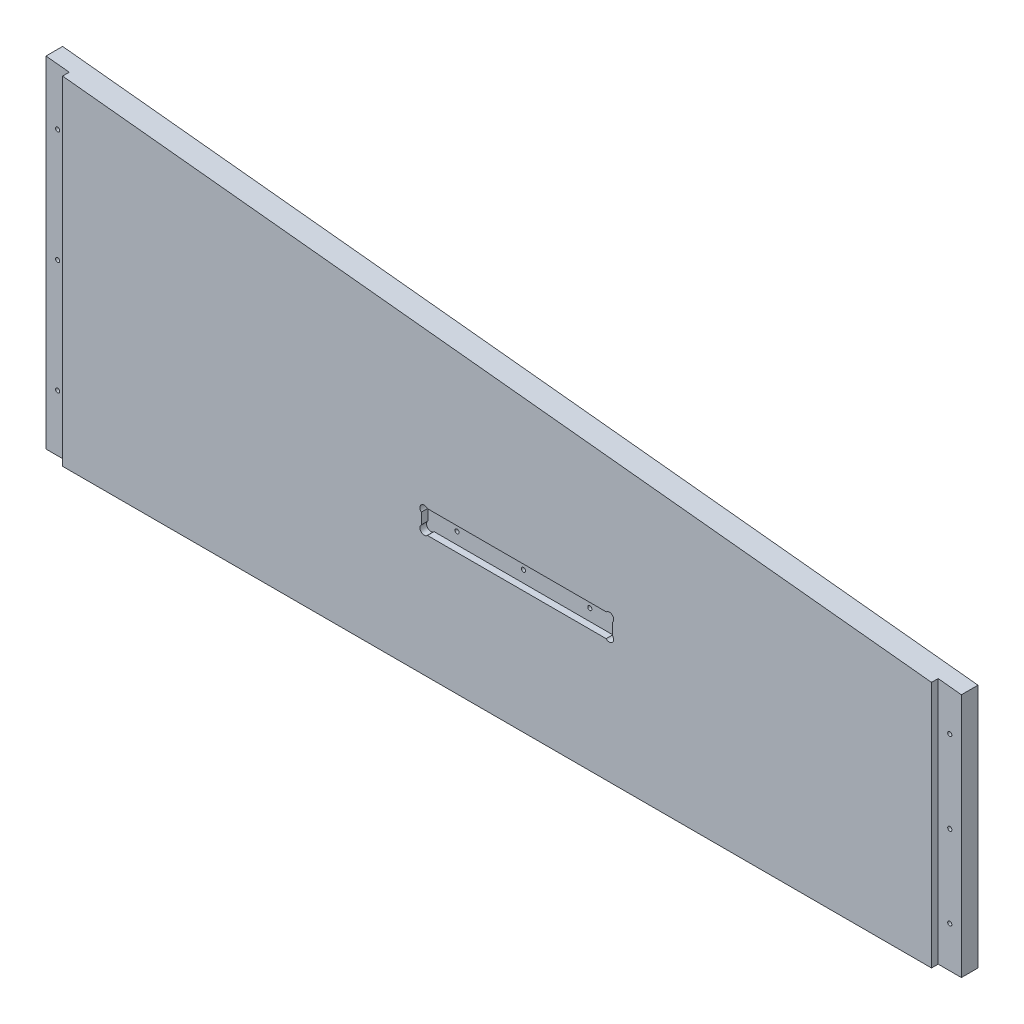
ISO-10303-21;
HEADER;
FILE_DESCRIPTION(('STEP AP214'),'2;1');
FILE_NAME('part.step','',(''),(''),'','','');
FILE_SCHEMA(('AUTOMOTIVE_DESIGN { 1 0 10303 214 1 1 1 1 }'));
ENDSEC;
DATA;
#1=APPLICATION_CONTEXT('core data for automotive mechanical design processes');
#2=APPLICATION_PROTOCOL_DEFINITION('international standard','automotive_design',2000,#1);
#3=PRODUCT_CONTEXT('',#1,'mechanical');
#4=PRODUCT('Part','Part','',(#3));
#5=PRODUCT_RELATED_PRODUCT_CATEGORY('part','',(#4));
#6=PRODUCT_DEFINITION_FORMATION('','',#4);
#7=PRODUCT_DEFINITION_CONTEXT('part definition',#1,'design');
#8=PRODUCT_DEFINITION('design','',#6,#7);
#9=PRODUCT_DEFINITION_SHAPE('','',#8);
#10=(LENGTH_UNIT() NAMED_UNIT(*) SI_UNIT(.MILLI.,.METRE.));
#11=(NAMED_UNIT(*) PLANE_ANGLE_UNIT() SI_UNIT($,.RADIAN.));
#12=(NAMED_UNIT(*) SI_UNIT($,.STERADIAN.) SOLID_ANGLE_UNIT());
#13=UNCERTAINTY_MEASURE_WITH_UNIT(LENGTH_MEASURE(1.E-05),#10,'distance_accuracy_value','');
#14=(GEOMETRIC_REPRESENTATION_CONTEXT(3) GLOBAL_UNCERTAINTY_ASSIGNED_CONTEXT((#13)) GLOBAL_UNIT_ASSIGNED_CONTEXT((#10,
#11,#12)) REPRESENTATION_CONTEXT('',''));
#15=CARTESIAN_POINT('',(0.,0.,0.));
#16=DIRECTION('',(0.,0.,1.));
#17=DIRECTION('',(1.,0.,0.));
#18=AXIS2_PLACEMENT_3D('',#15,#16,#17);
#19=CARTESIAN_POINT('',(471.4875,-5910.834,-22.270128060535));
#20=DIRECTION('',(0.,0.,1.));
#21=DIRECTION('',(1.,0.,0.));
#22=AXIS2_PLACEMENT_3D('',#19,#20,#21);
#23=CYLINDRICAL_SURFACE('',#22,1.58750000000001);
#24=CARTESIAN_POINT('',(471.4875,-5910.834,-17.78));
#25=DIRECTION('',(0.,0.,1.));
#26=DIRECTION('',(1.,0.,0.));
#27=AXIS2_PLACEMENT_3D('',#24,#25,#26);
#28=CIRCLE('',#27,1.58750000000001);
#29=CARTESIAN_POINT('',(473.075,-5910.834,-17.78));
#30=VERTEX_POINT('',#29);
#31=EDGE_CURVE('E196',#30,#30,#28,.F.);
#32=ORIENTED_EDGE('',*,*,#31,.T.);
#33=EDGE_LOOP('',(#32));
#34=FACE_BOUND('',#33,.T.);
#35=CARTESIAN_POINT('',(471.4875,-5910.834,-5.08));
#36=DIRECTION('',(0.,0.,1.));
#37=DIRECTION('',(1.,0.,0.));
#38=AXIS2_PLACEMENT_3D('',#35,#36,#37);
#39=CIRCLE('',#38,1.58750000000001);
#40=CARTESIAN_POINT('',(473.075,-5910.834,-5.08));
#41=VERTEX_POINT('',#40);
#42=EDGE_CURVE('E187',#41,#41,#39,.F.);
#43=ORIENTED_EDGE('',*,*,#42,.F.);
#44=EDGE_LOOP('',(#43));
#45=FACE_BOUND('',#44,.T.);
#46=ADVANCED_FACE('F30',(#34,#45),#23,.F.);
#47=CARTESIAN_POINT('',(522.2875,-5910.834,-22.270128060535));
#48=DIRECTION('',(0.,0.,1.));
#49=DIRECTION('',(1.,0.,0.));
#50=AXIS2_PLACEMENT_3D('',#47,#48,#49);
#51=CYLINDRICAL_SURFACE('',#50,1.58749999999985);
#52=CARTESIAN_POINT('',(522.2875,-5910.834,-17.78));
#53=DIRECTION('',(0.,0.,1.));
#54=DIRECTION('',(1.,0.,0.));
#55=AXIS2_PLACEMENT_3D('',#52,#53,#54);
#56=CIRCLE('',#55,1.58749999999985);
#57=CARTESIAN_POINT('',(523.875,-5910.834,-17.78));
#58=VERTEX_POINT('',#57);
#59=EDGE_CURVE('E193',#58,#58,#56,.F.);
#60=ORIENTED_EDGE('',*,*,#59,.T.);
#61=EDGE_LOOP('',(#60));
#62=FACE_BOUND('',#61,.T.);
#63=CARTESIAN_POINT('',(522.2875,-5910.834,-5.08));
#64=DIRECTION('',(0.,0.,1.));
#65=DIRECTION('',(1.,0.,0.));
#66=AXIS2_PLACEMENT_3D('',#63,#64,#65);
#67=CIRCLE('',#66,1.58749999999985);
#68=CARTESIAN_POINT('',(523.875,-5910.834,-5.08));
#69=VERTEX_POINT('',#68);
#70=EDGE_CURVE('E184',#69,#69,#67,.F.);
#71=ORIENTED_EDGE('',*,*,#70,.F.);
#72=EDGE_LOOP('',(#71));
#73=FACE_BOUND('',#72,.T.);
#74=ADVANCED_FACE('F319',(#62,#73),#51,.F.);
#75=CARTESIAN_POINT('',(573.0875,-5910.834,-22.270128060535));
#76=DIRECTION('',(0.,0.,1.));
#77=DIRECTION('',(1.,0.,0.));
#78=AXIS2_PLACEMENT_3D('',#75,#76,#77);
#79=CYLINDRICAL_SURFACE('',#78,1.58749999999996);
#80=CARTESIAN_POINT('',(573.0875,-5910.834,-17.78));
#81=DIRECTION('',(0.,0.,1.));
#82=DIRECTION('',(1.,0.,0.));
#83=AXIS2_PLACEMENT_3D('',#80,#81,#82);
#84=CIRCLE('',#83,1.58749999999996);
#85=CARTESIAN_POINT('',(574.675,-5910.834,-17.78));
#86=VERTEX_POINT('',#85);
#87=EDGE_CURVE('E190',#86,#86,#84,.F.);
#88=ORIENTED_EDGE('',*,*,#87,.T.);
#89=EDGE_LOOP('',(#88));
#90=FACE_BOUND('',#89,.T.);
#91=CARTESIAN_POINT('',(573.0875,-5910.834,-5.08));
#92=DIRECTION('',(0.,0.,1.));
#93=DIRECTION('',(1.,0.,0.));
#94=AXIS2_PLACEMENT_3D('',#91,#92,#93);
#95=CIRCLE('',#94,1.58749999999996);
#96=CARTESIAN_POINT('',(574.675,-5910.834,-5.08));
#97=VERTEX_POINT('',#96);
#98=EDGE_CURVE('E168',#97,#97,#95,.F.);
#99=ORIENTED_EDGE('',*,*,#98,.F.);
#100=EDGE_LOOP('',(#99));
#101=FACE_BOUND('',#100,.T.);
#102=ADVANCED_FACE('F325',(#90,#101),#79,.F.);
#103=CARTESIAN_POINT('',(839.47,-6013.45,-17.78));
#104=DIRECTION('',(1.,0.,0.));
#105=DIRECTION('',(0.,0.,-1.));
#106=AXIS2_PLACEMENT_3D('',#103,#104,#105);
#107=PLANE('',#106);
#108=DIRECTION('',(0.,0.,1.));
#109=VECTOR('',#108,1.);
#110=CARTESIAN_POINT('',(839.47,-6013.45,-17.78));
#111=LINE('',#110,#109);
#112=CARTESIAN_POINT('',(839.47,-6013.45,-5.08));
#113=VERTEX_POINT('',#112);
#114=CARTESIAN_POINT('',(839.47,-6013.45,0.));
#115=VERTEX_POINT('',#114);
#116=EDGE_CURVE('E397',#113,#115,#111,.T.);
#117=ORIENTED_EDGE('',*,*,#116,.F.);
#118=DIRECTION('',(0.,1.,0.));
#119=VECTOR('',#118,1.);
#120=CARTESIAN_POINT('',(839.47,-5824.2703968254,-5.08));
#121=LINE('',#120,#119);
#122=CARTESIAN_POINT('',(839.47,-5824.2703968254,-5.08));
#123=VERTEX_POINT('',#122);
#124=EDGE_CURVE('E228',#113,#123,#121,.T.);
#125=ORIENTED_EDGE('',*,*,#124,.T.);
#126=DIRECTION('',(0.,0.,1.));
#127=VECTOR('',#126,1.);
#128=CARTESIAN_POINT('',(839.47,-5824.2703968254,-17.78));
#129=LINE('',#128,#127);
#130=CARTESIAN_POINT('',(839.47,-5824.2703968254,0.));
#131=VERTEX_POINT('',#130);
#132=EDGE_CURVE('E232',#123,#131,#129,.T.);
#133=ORIENTED_EDGE('',*,*,#132,.T.);
#134=DIRECTION('',(0.,1.,0.));
#135=VECTOR('',#134,1.);
#136=CARTESIAN_POINT('',(839.47,-6013.45,0.));
#137=LINE('',#136,#135);
#138=EDGE_CURVE('E400',#115,#131,#137,.T.);
#139=ORIENTED_EDGE('',*,*,#138,.F.);
#140=EDGE_LOOP('',(#117,#125,#133,#139));
#141=FACE_BOUND('',#140,.T.);
#142=ADVANCED_FACE('F382',(#141),#107,.T.);
#143=CARTESIAN_POINT('',(174.9425,-5754.9546031746,-17.78));
#144=DIRECTION('',(-1.,0.,0.));
#145=DIRECTION('',(0.,-1.,0.));
#146=AXIS2_PLACEMENT_3D('',#143,#144,#145);
#147=PLANE('',#146);
#148=DIRECTION('',(0.,0.,1.));
#149=VECTOR('',#148,1.);
#150=CARTESIAN_POINT('',(174.9425,-5754.9546031746,-17.78));
#151=LINE('',#150,#149);
#152=CARTESIAN_POINT('',(174.9425,-5754.9546031746,-5.08));
#153=VERTEX_POINT('',#152);
#154=CARTESIAN_POINT('',(174.9425,-5754.9546031746,0.));
#155=VERTEX_POINT('',#154);
#156=EDGE_CURVE('E262',#153,#155,#151,.T.);
#157=ORIENTED_EDGE('',*,*,#156,.F.);
#158=DIRECTION('',(0.,-1.,0.));
#159=VECTOR('',#158,1.);
#160=CARTESIAN_POINT('',(174.9425,-5754.9546031746,-5.08));
#161=LINE('',#160,#159);
#162=CARTESIAN_POINT('',(174.9425,-6013.45,-5.08));
#163=VERTEX_POINT('',#162);
#164=EDGE_CURVE('E429',#153,#163,#161,.T.);
#165=ORIENTED_EDGE('',*,*,#164,.T.);
#166=DIRECTION('',(0.,0.,1.));
#167=VECTOR('',#166,1.);
#168=CARTESIAN_POINT('',(174.9425,-6013.45,-17.78));
#169=LINE('',#168,#167);
#170=CARTESIAN_POINT('',(174.9425,-6013.45,0.));
#171=VERTEX_POINT('',#170);
#172=EDGE_CURVE('E395',#163,#171,#169,.T.);
#173=ORIENTED_EDGE('',*,*,#172,.T.);
#174=DIRECTION('',(0.,-1.,0.));
#175=VECTOR('',#174,1.);
#176=CARTESIAN_POINT('',(174.9425,-5754.9546031746,0.));
#177=LINE('',#176,#175);
#178=EDGE_CURVE('E401',#155,#171,#177,.T.);
#179=ORIENTED_EDGE('',*,*,#178,.F.);
#180=EDGE_LOOP('',(#157,#165,#173,#179));
#181=FACE_BOUND('',#180,.T.);
#182=ADVANCED_FACE('F32',(#181),#147,.T.);
#183=CARTESIAN_POINT('',(839.47,-5824.2703968254,-17.78));
#184=DIRECTION('',(0.10374552875936,0.994603873540839,0.));
#185=DIRECTION('',(-0.994603873540839,0.10374552875936,0.));
#186=AXIS2_PLACEMENT_3D('',#183,#184,#185);
#187=PLANE('',#186);
#188=DIRECTION('',(-0.994603873540839,0.10374552875936,0.));
#189=VECTOR('',#188,1.);
#190=CARTESIAN_POINT('',(839.47,-5824.2703968254,0.));
#191=LINE('',#190,#189);
#192=EDGE_CURVE('E406',#131,#155,#191,.T.);
#193=ORIENTED_EDGE('',*,*,#192,.F.);
#194=ORIENTED_EDGE('',*,*,#132,.F.);
#195=DIRECTION('',(0.994603873540837,-0.103745528759374,0.));
#196=VECTOR('',#195,1.);
#197=CARTESIAN_POINT('',(857.25,-5826.125,-5.08));
#198=LINE('',#197,#196);
#199=CARTESIAN_POINT('',(857.25,-5826.125,-5.08));
#200=VERTEX_POINT('',#199);
#201=EDGE_CURVE('E53',#123,#200,#198,.T.);
#202=ORIENTED_EDGE('',*,*,#201,.T.);
#203=DIRECTION('',(0.,0.,-1.));
#204=VECTOR('',#203,1.);
#205=CARTESIAN_POINT('',(857.25,-5826.125,-5.08));
#206=LINE('',#205,#204);
#207=CARTESIAN_POINT('',(857.25,-5826.125,-17.78));
#208=VERTEX_POINT('',#207);
#209=EDGE_CURVE('E241',#200,#208,#206,.T.);
#210=ORIENTED_EDGE('',*,*,#209,.T.);
#211=DIRECTION('',(-0.994603873540839,0.10374552875936,0.));
#212=VECTOR('',#211,1.);
#213=CARTESIAN_POINT('',(839.47,-5824.2703968254,-17.78));
#214=LINE('',#213,#212);
#215=CARTESIAN_POINT('',(157.1625,-5753.1,-17.78));
#216=VERTEX_POINT('',#215);
#217=EDGE_CURVE('E415',#208,#216,#214,.T.);
#218=ORIENTED_EDGE('',*,*,#217,.T.);
#219=DIRECTION('',(0.,0.,-1.));
#220=VECTOR('',#219,1.);
#221=CARTESIAN_POINT('',(157.1625,-5753.1,-5.08));
#222=LINE('',#221,#220);
#223=CARTESIAN_POINT('',(157.1625,-5753.1,-5.08));
#224=VERTEX_POINT('',#223);
#225=EDGE_CURVE('E409',#224,#216,#222,.T.);
#226=ORIENTED_EDGE('',*,*,#225,.F.);
#227=DIRECTION('',(0.994603873540837,-0.103745528759375,0.));
#228=VECTOR('',#227,1.);
#229=CARTESIAN_POINT('',(157.1625,-5753.1,-5.08));
#230=LINE('',#229,#228);
#231=EDGE_CURVE('E443',#224,#153,#230,.T.);
#232=ORIENTED_EDGE('',*,*,#231,.T.);
#233=ORIENTED_EDGE('',*,*,#156,.T.);
#234=EDGE_LOOP('',(#193,#194,#202,#210,#218,#226,#232,#233));
#235=FACE_BOUND('',#234,.T.);
#236=ADVANCED_FACE('F378',(#235),#187,.T.);
#237=CARTESIAN_POINT('',(174.9425,-6013.45,-17.78));
#238=DIRECTION('',(0.,-1.,0.));
#239=DIRECTION('',(0.,0.,-1.));
#240=AXIS2_PLACEMENT_3D('',#237,#238,#239);
#241=PLANE('',#240);
#242=DIRECTION('',(1.,0.,0.));
#243=VECTOR('',#242,1.);
#244=CARTESIAN_POINT('',(174.9425,-6013.45,0.));
#245=LINE('',#244,#243);
#246=EDGE_CURVE('E392',#171,#115,#245,.T.);
#247=ORIENTED_EDGE('',*,*,#246,.F.);
#248=ORIENTED_EDGE('',*,*,#172,.F.);
#249=DIRECTION('',(-1.,0.,0.));
#250=VECTOR('',#249,1.);
#251=CARTESIAN_POINT('',(174.9425,-6013.45,-5.08));
#252=LINE('',#251,#250);
#253=CARTESIAN_POINT('',(157.1625,-6013.45,-5.08));
#254=VERTEX_POINT('',#253);
#255=EDGE_CURVE('E433',#163,#254,#252,.T.);
#256=ORIENTED_EDGE('',*,*,#255,.T.);
#257=DIRECTION('',(0.,0.,-1.));
#258=VECTOR('',#257,1.);
#259=CARTESIAN_POINT('',(157.1625,-6013.45,-5.08));
#260=LINE('',#259,#258);
#261=CARTESIAN_POINT('',(157.1625,-6013.45,-17.78));
#262=VERTEX_POINT('',#261);
#263=EDGE_CURVE('E412',#254,#262,#260,.T.);
#264=ORIENTED_EDGE('',*,*,#263,.T.);
#265=DIRECTION('',(1.,0.,0.));
#266=VECTOR('',#265,1.);
#267=CARTESIAN_POINT('',(174.9425,-6013.45,-17.78));
#268=LINE('',#267,#266);
#269=CARTESIAN_POINT('',(857.25,-6013.45,-17.78));
#270=VERTEX_POINT('',#269);
#271=EDGE_CURVE('E420',#262,#270,#268,.T.);
#272=ORIENTED_EDGE('',*,*,#271,.T.);
#273=DIRECTION('',(0.,0.,-1.));
#274=VECTOR('',#273,1.);
#275=CARTESIAN_POINT('',(857.25,-6013.45,-5.08));
#276=LINE('',#275,#274);
#277=CARTESIAN_POINT('',(857.25,-6013.45,-5.08));
#278=VERTEX_POINT('',#277);
#279=EDGE_CURVE('E445',#278,#270,#276,.T.);
#280=ORIENTED_EDGE('',*,*,#279,.F.);
#281=DIRECTION('',(-1.,0.,0.));
#282=VECTOR('',#281,1.);
#283=CARTESIAN_POINT('',(839.47,-6013.45,-5.08));
#284=LINE('',#283,#282);
#285=EDGE_CURVE('E238',#278,#113,#284,.T.);
#286=ORIENTED_EDGE('',*,*,#285,.T.);
#287=ORIENTED_EDGE('',*,*,#116,.T.);
#288=EDGE_LOOP('',(#247,#248,#256,#264,#272,#280,#286,#287));
#289=FACE_BOUND('',#288,.T.);
#290=ADVANCED_FACE('F374',(#289),#241,.T.);
#291=CARTESIAN_POINT('',(174.9425,-6013.45,-17.78));
#292=DIRECTION('',(0.,0.,1.));
#293=DIRECTION('',(1.,0.,0.));
#294=AXIS2_PLACEMENT_3D('',#291,#292,#293);
#295=PLANE('',#294);
#296=ORIENTED_EDGE('',*,*,#87,.F.);
#297=EDGE_LOOP('',(#296));
#298=FACE_BOUND('',#297,.T.);
#299=ORIENTED_EDGE('',*,*,#59,.F.);
#300=EDGE_LOOP('',(#299));
#301=FACE_BOUND('',#300,.T.);
#302=ORIENTED_EDGE('',*,*,#31,.F.);
#303=EDGE_LOOP('',(#302));
#304=FACE_BOUND('',#303,.T.);
#305=CARTESIAN_POINT('',(848.36,-5856.57308200948,-17.78));
#306=DIRECTION('',(0.,0.,1.));
#307=DIRECTION('',(1.,0.,0.));
#308=AXIS2_PLACEMENT_3D('',#305,#306,#307);
#309=CIRCLE('',#308,1.58749999999964);
#310=CARTESIAN_POINT('',(849.9475,-5856.57308200948,-17.78));
#311=VERTEX_POINT('',#310);
#312=EDGE_CURVE('E199',#311,#311,#309,.F.);
#313=ORIENTED_EDGE('',*,*,#312,.F.);
#314=EDGE_LOOP('',(#313));
#315=FACE_BOUND('',#314,.T.);
#316=CARTESIAN_POINT('',(848.36,-5919.32384920518,-17.78));
#317=DIRECTION('',(0.,0.,1.));
#318=DIRECTION('',(1.,0.,0.));
#319=AXIS2_PLACEMENT_3D('',#316,#317,#318);
#320=CIRCLE('',#319,1.58749999999974);
#321=CARTESIAN_POINT('',(849.9475,-5919.32384920518,-17.78));
#322=VERTEX_POINT('',#321);
#323=EDGE_CURVE('E203',#322,#322,#320,.F.);
#324=ORIENTED_EDGE('',*,*,#323,.F.);
#325=EDGE_LOOP('',(#324));
#326=FACE_BOUND('',#325,.T.);
#327=CARTESIAN_POINT('',(848.36,-5982.07461640088,-17.78));
#328=DIRECTION('',(0.,0.,1.));
#329=DIRECTION('',(1.,0.,0.));
#330=AXIS2_PLACEMENT_3D('',#327,#328,#329);
#331=CIRCLE('',#330,1.58749999999974);
#332=CARTESIAN_POINT('',(849.9475,-5982.07461640088,-17.78));
#333=VERTEX_POINT('',#332);
#334=EDGE_CURVE('E207',#333,#333,#331,.F.);
#335=ORIENTED_EDGE('',*,*,#334,.F.);
#336=EDGE_LOOP('',(#335));
#337=FACE_BOUND('',#336,.T.);
#338=CARTESIAN_POINT('',(166.0525,-5797.26441799052,-17.78));
#339=DIRECTION('',(0.,0.,1.));
#340=DIRECTION('',(1.,0.,0.));
#341=AXIS2_PLACEMENT_3D('',#338,#339,#340);
#342=CIRCLE('',#341,1.58749999999977);
#343=CARTESIAN_POINT('',(167.64,-5797.26441799052,-17.78));
#344=VERTEX_POINT('',#343);
#345=EDGE_CURVE('E211',#344,#344,#342,.F.);
#346=ORIENTED_EDGE('',*,*,#345,.F.);
#347=EDGE_LOOP('',(#346));
#348=FACE_BOUND('',#347,.T.);
#349=CARTESIAN_POINT('',(166.0525,-5883.73865079482,-17.78));
#350=DIRECTION('',(0.,0.,1.));
#351=DIRECTION('',(1.,0.,0.));
#352=AXIS2_PLACEMENT_3D('',#349,#350,#351);
#353=CIRCLE('',#352,1.5874999999999);
#354=CARTESIAN_POINT('',(167.64,-5883.73865079482,-17.78));
#355=VERTEX_POINT('',#354);
#356=EDGE_CURVE('E215',#355,#355,#353,.F.);
#357=ORIENTED_EDGE('',*,*,#356,.F.);
#358=EDGE_LOOP('',(#357));
#359=FACE_BOUND('',#358,.T.);
#360=CARTESIAN_POINT('',(166.0525,-5970.21288359912,-17.78));
#361=DIRECTION('',(0.,0.,1.));
#362=DIRECTION('',(1.,0.,0.));
#363=AXIS2_PLACEMENT_3D('',#360,#361,#362);
#364=CIRCLE('',#363,1.58749999999977);
#365=CARTESIAN_POINT('',(167.64,-5970.21288359912,-17.78));
#366=VERTEX_POINT('',#365);
#367=EDGE_CURVE('E219',#366,#366,#364,.F.);
#368=ORIENTED_EDGE('',*,*,#367,.F.);
#369=EDGE_LOOP('',(#368));
#370=FACE_BOUND('',#369,.T.);
#371=ORIENTED_EDGE('',*,*,#271,.F.);
#372=DIRECTION('',(0.,1.,0.));
#373=VECTOR('',#372,1.);
#374=CARTESIAN_POINT('',(157.1625,-6013.45,-17.78));
#375=LINE('',#374,#373);
#376=EDGE_CURVE('E434',#262,#216,#375,.T.);
#377=ORIENTED_EDGE('',*,*,#376,.T.);
#378=ORIENTED_EDGE('',*,*,#217,.F.);
#379=DIRECTION('',(0.,-1.,0.));
#380=VECTOR('',#379,1.);
#381=CARTESIAN_POINT('',(857.25,-6013.45,-17.78));
#382=LINE('',#381,#380);
#383=EDGE_CURVE('E231',#208,#270,#382,.T.);
#384=ORIENTED_EDGE('',*,*,#383,.T.);
#385=EDGE_LOOP('',(#371,#377,#378,#384));
#386=FACE_BOUND('',#385,.T.);
#387=ADVANCED_FACE('F371',(#298,#301,#304,#315,#326,#337,#348,#359,#370,#386),#295,.F.);
#388=CARTESIAN_POINT('',(174.9425,-6013.45,0.));
#389=DIRECTION('',(0.,0.,1.));
#390=DIRECTION('',(1.,0.,0.));
#391=AXIS2_PLACEMENT_3D('',#388,#389,#390);
#392=PLANE('',#391);
#393=CARTESIAN_POINT('',(593.06743597096,-5904.18906403027,0.));
#394=DIRECTION('',(0.,0.,1.));
#395=DIRECTION('',(1.,0.,0.));
#396=AXIS2_PLACEMENT_3D('',#393,#394,#395);
#397=CIRCLE('',#396,3.30200000000022);
#398=CARTESIAN_POINT('',(595.312500001227,-5906.61040487781,0.));
#399=VERTEX_POINT('',#398);
#400=CARTESIAN_POINT('',(590.646095123413,-5901.944,0.));
#401=VERTEX_POINT('',#400);
#402=EDGE_CURVE('E151',#399,#401,#397,.T.);
#403=ORIENTED_EDGE('',*,*,#402,.F.);
#404=DIRECTION('',(0.,1.,0.));
#405=VECTOR('',#404,1.);
#406=CARTESIAN_POINT('',(595.312500001227,-5901.944,0.));
#407=LINE('',#406,#405);
#408=CARTESIAN_POINT('',(595.312500001227,-5915.05759512219,0.));
#409=VERTEX_POINT('',#408);
#410=EDGE_CURVE('E160',#409,#399,#407,.T.);
#411=ORIENTED_EDGE('',*,*,#410,.F.);
#412=CARTESIAN_POINT('',(593.06743597096,-5917.47893596973,0.));
#413=DIRECTION('',(0.,0.,1.));
#414=DIRECTION('',(1.,0.,0.));
#415=AXIS2_PLACEMENT_3D('',#412,#413,#414);
#416=CIRCLE('',#415,3.30199999999948);
#417=CARTESIAN_POINT('',(590.646095123414,-5919.724,0.));
#418=VERTEX_POINT('',#417);
#419=EDGE_CURVE('E272',#418,#409,#416,.T.);
#420=ORIENTED_EDGE('',*,*,#419,.F.);
#421=DIRECTION('',(1.,0.,0.));
#422=VECTOR('',#421,1.);
#423=CARTESIAN_POINT('',(449.262499998773,-5919.724,0.));
#424=LINE('',#423,#422);
#425=CARTESIAN_POINT('',(453.928904876587,-5919.724,0.));
#426=VERTEX_POINT('',#425);
#427=EDGE_CURVE('E177',#426,#418,#424,.T.);
#428=ORIENTED_EDGE('',*,*,#427,.F.);
#429=CARTESIAN_POINT('',(451.50756402904,-5917.47893596973,0.));
#430=DIRECTION('',(0.,0.,1.));
#431=DIRECTION('',(1.,0.,0.));
#432=AXIS2_PLACEMENT_3D('',#429,#430,#431);
#433=CIRCLE('',#432,3.30200000000054);
#434=CARTESIAN_POINT('',(449.262499998773,-5915.05759512218,0.));
#435=VERTEX_POINT('',#434);
#436=EDGE_CURVE('E283',#435,#426,#433,.T.);
#437=ORIENTED_EDGE('',*,*,#436,.F.);
#438=DIRECTION('',(0.,-1.,0.));
#439=VECTOR('',#438,1.);
#440=CARTESIAN_POINT('',(449.262499998773,-5901.944,0.));
#441=LINE('',#440,#439);
#442=CARTESIAN_POINT('',(449.262499998773,-5906.61040487781,0.));
#443=VERTEX_POINT('',#442);
#444=EDGE_CURVE('E174',#443,#435,#441,.T.);
#445=ORIENTED_EDGE('',*,*,#444,.F.);
#446=CARTESIAN_POINT('',(451.50756402904,-5904.18906403027,0.));
#447=DIRECTION('',(0.,0.,1.));
#448=DIRECTION('',(1.,0.,0.));
#449=AXIS2_PLACEMENT_3D('',#446,#447,#448);
#450=CIRCLE('',#449,3.30199999999938);
#451=CARTESIAN_POINT('',(453.928904876586,-5901.944,0.));
#452=VERTEX_POINT('',#451);
#453=EDGE_CURVE('E289',#452,#443,#450,.T.);
#454=ORIENTED_EDGE('',*,*,#453,.F.);
#455=DIRECTION('',(-1.,0.,0.));
#456=VECTOR('',#455,1.);
#457=CARTESIAN_POINT('',(449.262499998773,-5901.944,0.));
#458=LINE('',#457,#456);
#459=EDGE_CURVE('E182',#401,#452,#458,.T.);
#460=ORIENTED_EDGE('',*,*,#459,.F.);
#461=EDGE_LOOP('',(#403,#411,#420,#428,#437,#445,#454,#460));
#462=FACE_BOUND('',#461,.T.);
#463=ORIENTED_EDGE('',*,*,#178,.T.);
#464=ORIENTED_EDGE('',*,*,#246,.T.);
#465=ORIENTED_EDGE('',*,*,#138,.T.);
#466=ORIENTED_EDGE('',*,*,#192,.T.);
#467=EDGE_LOOP('',(#463,#464,#465,#466));
#468=FACE_BOUND('',#467,.T.);
#469=ADVANCED_FACE('F274',(#462,#468),#392,.T.);
#470=CARTESIAN_POINT('',(157.1625,-6013.45,-5.08));
#471=DIRECTION('',(-1.,0.,0.));
#472=DIRECTION('',(0.,0.,1.));
#473=AXIS2_PLACEMENT_3D('',#470,#471,#472);
#474=PLANE('',#473);
#475=ORIENTED_EDGE('',*,*,#376,.F.);
#476=ORIENTED_EDGE('',*,*,#263,.F.);
#477=DIRECTION('',(0.,1.,0.));
#478=VECTOR('',#477,1.);
#479=CARTESIAN_POINT('',(157.1625,-6013.45,-5.08));
#480=LINE('',#479,#478);
#481=EDGE_CURVE('E440',#254,#224,#480,.T.);
#482=ORIENTED_EDGE('',*,*,#481,.T.);
#483=ORIENTED_EDGE('',*,*,#225,.T.);
#484=EDGE_LOOP('',(#475,#476,#482,#483));
#485=FACE_BOUND('',#484,.T.);
#486=ADVANCED_FACE('F366',(#485),#474,.T.);
#487=CARTESIAN_POINT('',(174.9425,-6013.45,-5.08));
#488=DIRECTION('',(0.,0.,-1.));
#489=DIRECTION('',(-1.,0.,0.));
#490=AXIS2_PLACEMENT_3D('',#487,#488,#489);
#491=PLANE('',#490);
#492=CARTESIAN_POINT('',(166.0525,-5797.26441799052,-5.08));
#493=DIRECTION('',(0.,0.,-1.));
#494=DIRECTION('',(-1.,0.,0.));
#495=AXIS2_PLACEMENT_3D('',#492,#493,#494);
#496=CIRCLE('',#495,1.58749999999977);
#497=CARTESIAN_POINT('',(164.465,-5797.26441799052,-5.08));
#498=VERTEX_POINT('',#497);
#499=EDGE_CURVE('E214',#498,#498,#496,.T.);
#500=ORIENTED_EDGE('',*,*,#499,.T.);
#501=EDGE_LOOP('',(#500));
#502=FACE_BOUND('',#501,.T.);
#503=CARTESIAN_POINT('',(166.0525,-5883.73865079482,-5.08));
#504=DIRECTION('',(0.,0.,-1.));
#505=DIRECTION('',(-1.,0.,0.));
#506=AXIS2_PLACEMENT_3D('',#503,#504,#505);
#507=CIRCLE('',#506,1.5874999999999);
#508=CARTESIAN_POINT('',(164.465,-5883.73865079482,-5.08));
#509=VERTEX_POINT('',#508);
#510=EDGE_CURVE('E218',#509,#509,#507,.T.);
#511=ORIENTED_EDGE('',*,*,#510,.T.);
#512=EDGE_LOOP('',(#511));
#513=FACE_BOUND('',#512,.T.);
#514=CARTESIAN_POINT('',(166.0525,-5970.21288359912,-5.08));
#515=DIRECTION('',(0.,0.,-1.));
#516=DIRECTION('',(-1.,0.,0.));
#517=AXIS2_PLACEMENT_3D('',#514,#515,#516);
#518=CIRCLE('',#517,1.58749999999977);
#519=CARTESIAN_POINT('',(164.465,-5970.21288359912,-5.08));
#520=VERTEX_POINT('',#519);
#521=EDGE_CURVE('E222',#520,#520,#518,.T.);
#522=ORIENTED_EDGE('',*,*,#521,.T.);
#523=EDGE_LOOP('',(#522));
#524=FACE_BOUND('',#523,.T.);
#525=ORIENTED_EDGE('',*,*,#164,.F.);
#526=ORIENTED_EDGE('',*,*,#231,.F.);
#527=ORIENTED_EDGE('',*,*,#481,.F.);
#528=ORIENTED_EDGE('',*,*,#255,.F.);
#529=EDGE_LOOP('',(#525,#526,#527,#528));
#530=FACE_BOUND('',#529,.T.);
#531=ADVANCED_FACE('F362',(#502,#513,#524,#530),#491,.F.);
#532=CARTESIAN_POINT('',(857.25,-6013.45,-5.08));
#533=DIRECTION('',(1.,0.,0.));
#534=DIRECTION('',(0.,0.,-1.));
#535=AXIS2_PLACEMENT_3D('',#532,#533,#534);
#536=PLANE('',#535);
#537=ORIENTED_EDGE('',*,*,#383,.F.);
#538=ORIENTED_EDGE('',*,*,#209,.F.);
#539=DIRECTION('',(0.,-1.,0.));
#540=VECTOR('',#539,1.);
#541=CARTESIAN_POINT('',(857.25,-6013.45,-5.08));
#542=LINE('',#541,#540);
#543=EDGE_CURVE('E225',#200,#278,#542,.T.);
#544=ORIENTED_EDGE('',*,*,#543,.T.);
#545=ORIENTED_EDGE('',*,*,#279,.T.);
#546=EDGE_LOOP('',(#537,#538,#544,#545));
#547=FACE_BOUND('',#546,.T.);
#548=ADVANCED_FACE('F358',(#547),#536,.T.);
#549=CARTESIAN_POINT('',(839.47,-6013.45,-5.08));
#550=DIRECTION('',(0.,0.,1.));
#551=DIRECTION('',(1.,0.,0.));
#552=AXIS2_PLACEMENT_3D('',#549,#550,#551);
#553=PLANE('',#552);
#554=CARTESIAN_POINT('',(848.36,-5856.57308200948,-5.08));
#555=DIRECTION('',(0.,0.,1.));
#556=DIRECTION('',(1.,0.,0.));
#557=AXIS2_PLACEMENT_3D('',#554,#555,#556);
#558=CIRCLE('',#557,1.58749999999964);
#559=CARTESIAN_POINT('',(849.9475,-5856.57308200948,-5.08));
#560=VERTEX_POINT('',#559);
#561=EDGE_CURVE('E202',#560,#560,#558,.T.);
#562=ORIENTED_EDGE('',*,*,#561,.F.);
#563=EDGE_LOOP('',(#562));
#564=FACE_BOUND('',#563,.T.);
#565=CARTESIAN_POINT('',(848.36,-5919.32384920518,-5.08));
#566=DIRECTION('',(0.,0.,1.));
#567=DIRECTION('',(1.,0.,0.));
#568=AXIS2_PLACEMENT_3D('',#565,#566,#567);
#569=CIRCLE('',#568,1.58749999999974);
#570=CARTESIAN_POINT('',(849.9475,-5919.32384920518,-5.08));
#571=VERTEX_POINT('',#570);
#572=EDGE_CURVE('E206',#571,#571,#569,.T.);
#573=ORIENTED_EDGE('',*,*,#572,.F.);
#574=EDGE_LOOP('',(#573));
#575=FACE_BOUND('',#574,.T.);
#576=CARTESIAN_POINT('',(848.36,-5982.07461640088,-5.08));
#577=DIRECTION('',(0.,0.,1.));
#578=DIRECTION('',(1.,0.,0.));
#579=AXIS2_PLACEMENT_3D('',#576,#577,#578);
#580=CIRCLE('',#579,1.58749999999974);
#581=CARTESIAN_POINT('',(849.9475,-5982.07461640088,-5.08));
#582=VERTEX_POINT('',#581);
#583=EDGE_CURVE('E210',#582,#582,#580,.T.);
#584=ORIENTED_EDGE('',*,*,#583,.F.);
#585=EDGE_LOOP('',(#584));
#586=FACE_BOUND('',#585,.T.);
#587=ORIENTED_EDGE('',*,*,#124,.F.);
#588=ORIENTED_EDGE('',*,*,#285,.F.);
#589=ORIENTED_EDGE('',*,*,#543,.F.);
#590=ORIENTED_EDGE('',*,*,#201,.F.);
#591=EDGE_LOOP('',(#587,#588,#589,#590));
#592=FACE_BOUND('',#591,.T.);
#593=ADVANCED_FACE('F354',(#564,#575,#586,#592),#553,.T.);
#594=CARTESIAN_POINT('',(166.0525,-5970.21288359912,-22.270128060535));
#595=DIRECTION('',(0.,0.,1.));
#596=DIRECTION('',(1.,0.,0.));
#597=AXIS2_PLACEMENT_3D('',#594,#595,#596);
#598=CYLINDRICAL_SURFACE('',#597,1.58749999999977);
#599=ORIENTED_EDGE('',*,*,#367,.T.);
#600=EDGE_LOOP('',(#599));
#601=FACE_BOUND('',#600,.T.);
#602=ORIENTED_EDGE('',*,*,#521,.F.);
#603=EDGE_LOOP('',(#602));
#604=FACE_BOUND('',#603,.T.);
#605=ADVANCED_FACE('F350',(#601,#604),#598,.F.);
#606=CARTESIAN_POINT('',(166.0525,-5883.73865079482,-22.270128060535));
#607=DIRECTION('',(0.,0.,1.));
#608=DIRECTION('',(1.,0.,0.));
#609=AXIS2_PLACEMENT_3D('',#606,#607,#608);
#610=CYLINDRICAL_SURFACE('',#609,1.5874999999999);
#611=ORIENTED_EDGE('',*,*,#356,.T.);
#612=EDGE_LOOP('',(#611));
#613=FACE_BOUND('',#612,.T.);
#614=ORIENTED_EDGE('',*,*,#510,.F.);
#615=EDGE_LOOP('',(#614));
#616=FACE_BOUND('',#615,.T.);
#617=ADVANCED_FACE('F346',(#613,#616),#610,.F.);
#618=CARTESIAN_POINT('',(166.0525,-5797.26441799052,-22.270128060535));
#619=DIRECTION('',(0.,0.,1.));
#620=DIRECTION('',(1.,0.,0.));
#621=AXIS2_PLACEMENT_3D('',#618,#619,#620);
#622=CYLINDRICAL_SURFACE('',#621,1.58749999999977);
#623=ORIENTED_EDGE('',*,*,#345,.T.);
#624=EDGE_LOOP('',(#623));
#625=FACE_BOUND('',#624,.T.);
#626=ORIENTED_EDGE('',*,*,#499,.F.);
#627=EDGE_LOOP('',(#626));
#628=FACE_BOUND('',#627,.T.);
#629=ADVANCED_FACE('F342',(#625,#628),#622,.F.);
#630=CARTESIAN_POINT('',(848.36,-5982.07461640088,-22.270128060535));
#631=DIRECTION('',(0.,0.,1.));
#632=DIRECTION('',(1.,0.,0.));
#633=AXIS2_PLACEMENT_3D('',#630,#631,#632);
#634=CYLINDRICAL_SURFACE('',#633,1.58749999999974);
#635=ORIENTED_EDGE('',*,*,#583,.T.);
#636=EDGE_LOOP('',(#635));
#637=FACE_BOUND('',#636,.T.);
#638=ORIENTED_EDGE('',*,*,#334,.T.);
#639=EDGE_LOOP('',(#638));
#640=FACE_BOUND('',#639,.T.);
#641=ADVANCED_FACE('F338',(#637,#640),#634,.F.);
#642=CARTESIAN_POINT('',(848.36,-5919.32384920518,-22.270128060535));
#643=DIRECTION('',(0.,0.,1.));
#644=DIRECTION('',(1.,0.,0.));
#645=AXIS2_PLACEMENT_3D('',#642,#643,#644);
#646=CYLINDRICAL_SURFACE('',#645,1.58749999999974);
#647=ORIENTED_EDGE('',*,*,#572,.T.);
#648=EDGE_LOOP('',(#647));
#649=FACE_BOUND('',#648,.T.);
#650=ORIENTED_EDGE('',*,*,#323,.T.);
#651=EDGE_LOOP('',(#650));
#652=FACE_BOUND('',#651,.T.);
#653=ADVANCED_FACE('F334',(#649,#652),#646,.F.);
#654=CARTESIAN_POINT('',(848.36,-5856.57308200948,-22.270128060535));
#655=DIRECTION('',(0.,0.,1.));
#656=DIRECTION('',(1.,0.,0.));
#657=AXIS2_PLACEMENT_3D('',#654,#655,#656);
#658=CYLINDRICAL_SURFACE('',#657,1.58749999999964);
#659=ORIENTED_EDGE('',*,*,#561,.T.);
#660=EDGE_LOOP('',(#659));
#661=FACE_BOUND('',#660,.T.);
#662=ORIENTED_EDGE('',*,*,#312,.T.);
#663=EDGE_LOOP('',(#662));
#664=FACE_BOUND('',#663,.T.);
#665=ADVANCED_FACE('F331',(#661,#664),#658,.F.);
#666=CARTESIAN_POINT('',(449.262499998773,-5919.724,-5.08));
#667=DIRECTION('',(0.,0.,1.));
#668=DIRECTION('',(1.,0.,0.));
#669=AXIS2_PLACEMENT_3D('',#666,#667,#668);
#670=PLANE('',#669);
#671=DIRECTION('',(0.,1.,0.));
#672=VECTOR('',#671,1.);
#673=CARTESIAN_POINT('',(595.312500001227,-5901.944,-5.08));
#674=LINE('',#673,#672);
#675=CARTESIAN_POINT('',(595.312500001227,-5915.05759512219,-5.08));
#676=VERTEX_POINT('',#675);
#677=CARTESIAN_POINT('',(595.312500001227,-5906.61040487781,-5.08));
#678=VERTEX_POINT('',#677);
#679=EDGE_CURVE('E158',#676,#678,#674,.T.);
#680=ORIENTED_EDGE('',*,*,#679,.T.);
#681=CARTESIAN_POINT('',(593.06743597096,-5904.18906403027,-5.08));
#682=DIRECTION('',(0.,0.,1.));
#683=DIRECTION('',(1.,0.,0.));
#684=AXIS2_PLACEMENT_3D('',#681,#682,#683);
#685=CIRCLE('',#684,3.30200000000022);
#686=CARTESIAN_POINT('',(590.646095123413,-5901.944,-5.08));
#687=VERTEX_POINT('',#686);
#688=EDGE_CURVE('E144',#687,#678,#685,.F.);
#689=ORIENTED_EDGE('',*,*,#688,.F.);
#690=DIRECTION('',(-1.,0.,0.));
#691=VECTOR('',#690,1.);
#692=CARTESIAN_POINT('',(449.262499998773,-5901.944,-5.08));
#693=LINE('',#692,#691);
#694=CARTESIAN_POINT('',(453.928904876586,-5901.944,-5.08));
#695=VERTEX_POINT('',#694);
#696=EDGE_CURVE('E165',#687,#695,#693,.T.);
#697=ORIENTED_EDGE('',*,*,#696,.T.);
#698=CARTESIAN_POINT('',(451.50756402904,-5904.18906403027,-5.08));
#699=DIRECTION('',(0.,0.,1.));
#700=DIRECTION('',(1.,0.,0.));
#701=AXIS2_PLACEMENT_3D('',#698,#699,#700);
#702=CIRCLE('',#701,3.30199999999938);
#703=CARTESIAN_POINT('',(449.262499998773,-5906.61040487781,-5.08));
#704=VERTEX_POINT('',#703);
#705=EDGE_CURVE('E291',#704,#695,#702,.F.);
#706=ORIENTED_EDGE('',*,*,#705,.F.);
#707=DIRECTION('',(0.,-1.,0.));
#708=VECTOR('',#707,1.);
#709=CARTESIAN_POINT('',(449.262499998773,-5901.944,-5.08));
#710=LINE('',#709,#708);
#711=CARTESIAN_POINT('',(449.262499998773,-5915.05759512218,-5.08));
#712=VERTEX_POINT('',#711);
#713=EDGE_CURVE('E170',#704,#712,#710,.T.);
#714=ORIENTED_EDGE('',*,*,#713,.T.);
#715=CARTESIAN_POINT('',(451.50756402904,-5917.47893596973,-5.08));
#716=DIRECTION('',(0.,0.,1.));
#717=DIRECTION('',(1.,0.,0.));
#718=AXIS2_PLACEMENT_3D('',#715,#716,#717);
#719=CIRCLE('',#718,3.30200000000054);
#720=CARTESIAN_POINT('',(453.928904876587,-5919.724,-5.08));
#721=VERTEX_POINT('',#720);
#722=EDGE_CURVE('E45',#721,#712,#719,.F.);
#723=ORIENTED_EDGE('',*,*,#722,.F.);
#724=DIRECTION('',(1.,0.,0.));
#725=VECTOR('',#724,1.);
#726=CARTESIAN_POINT('',(449.262499998773,-5919.724,-5.08));
#727=LINE('',#726,#725);
#728=CARTESIAN_POINT('',(590.646095123414,-5919.724,-5.08));
#729=VERTEX_POINT('',#728);
#730=EDGE_CURVE('E166',#721,#729,#727,.T.);
#731=ORIENTED_EDGE('',*,*,#730,.T.);
#732=CARTESIAN_POINT('',(593.06743597096,-5917.47893596973,-5.08));
#733=DIRECTION('',(0.,0.,1.));
#734=DIRECTION('',(1.,0.,0.));
#735=AXIS2_PLACEMENT_3D('',#732,#733,#734);
#736=CIRCLE('',#735,3.30199999999948);
#737=EDGE_CURVE('E164',#676,#729,#736,.F.);
#738=ORIENTED_EDGE('',*,*,#737,.F.);
#739=EDGE_LOOP('',(#680,#689,#697,#706,#714,#723,#731,#738));
#740=FACE_BOUND('',#739,.T.);
#741=ORIENTED_EDGE('',*,*,#70,.T.);
#742=EDGE_LOOP('',(#741));
#743=FACE_BOUND('',#742,.T.);
#744=ORIENTED_EDGE('',*,*,#98,.T.);
#745=EDGE_LOOP('',(#744));
#746=FACE_BOUND('',#745,.T.);
#747=ORIENTED_EDGE('',*,*,#42,.T.);
#748=EDGE_LOOP('',(#747));
#749=FACE_BOUND('',#748,.T.);
#750=ADVANCED_FACE('F162',(#740,#743,#746,#749),#670,.T.);
#751=CARTESIAN_POINT('',(449.262499998773,-5901.944,-5.08));
#752=DIRECTION('',(-1.,0.,0.));
#753=DIRECTION('',(0.,0.,1.));
#754=AXIS2_PLACEMENT_3D('',#751,#752,#753);
#755=PLANE('',#754);
#756=ORIENTED_EDGE('',*,*,#444,.T.);
#757=DIRECTION('',(0.,0.,1.));
#758=VECTOR('',#757,1.);
#759=CARTESIAN_POINT('',(449.262499998773,-5915.05759512218,-14.4194663659135));
#760=LINE('',#759,#758);
#761=EDGE_CURVE('E286',#435,#712,#760,.F.);
#762=ORIENTED_EDGE('',*,*,#761,.T.);
#763=ORIENTED_EDGE('',*,*,#713,.F.);
#764=DIRECTION('',(0.,0.,1.));
#765=VECTOR('',#764,1.);
#766=CARTESIAN_POINT('',(449.262499998773,-5906.61040487781,-14.4194663659135));
#767=LINE('',#766,#765);
#768=EDGE_CURVE('E178',#704,#443,#767,.T.);
#769=ORIENTED_EDGE('',*,*,#768,.T.);
#770=EDGE_LOOP('',(#756,#762,#763,#769));
#771=FACE_BOUND('',#770,.T.);
#772=ADVANCED_FACE('F298',(#771),#755,.F.);
#773=CARTESIAN_POINT('',(449.262499998773,-5901.944,-5.08));
#774=DIRECTION('',(0.,1.,0.));
#775=DIRECTION('',(0.,0.,1.));
#776=AXIS2_PLACEMENT_3D('',#773,#774,#775);
#777=PLANE('',#776);
#778=ORIENTED_EDGE('',*,*,#696,.F.);
#779=DIRECTION('',(0.,0.,1.));
#780=VECTOR('',#779,1.);
#781=CARTESIAN_POINT('',(590.646095123413,-5901.944,-14.4194663659135));
#782=LINE('',#781,#780);
#783=EDGE_CURVE('E148',#687,#401,#782,.T.);
#784=ORIENTED_EDGE('',*,*,#783,.T.);
#785=ORIENTED_EDGE('',*,*,#459,.T.);
#786=DIRECTION('',(0.,0.,1.));
#787=VECTOR('',#786,1.);
#788=CARTESIAN_POINT('',(453.928904876586,-5901.944,-14.4194663659135));
#789=LINE('',#788,#787);
#790=EDGE_CURVE('E258',#452,#695,#789,.F.);
#791=ORIENTED_EDGE('',*,*,#790,.T.);
#792=EDGE_LOOP('',(#778,#784,#785,#791));
#793=FACE_BOUND('',#792,.T.);
#794=ADVANCED_FACE('F308',(#793),#777,.F.);
#795=CARTESIAN_POINT('',(595.312500001227,-5901.944,-5.08));
#796=DIRECTION('',(1.,0.,0.));
#797=DIRECTION('',(0.,0.,-1.));
#798=AXIS2_PLACEMENT_3D('',#795,#796,#797);
#799=PLANE('',#798);
#800=ORIENTED_EDGE('',*,*,#410,.T.);
#801=DIRECTION('',(0.,0.,1.));
#802=VECTOR('',#801,1.);
#803=CARTESIAN_POINT('',(595.312500001227,-5906.61040487781,-14.4194663659135));
#804=LINE('',#803,#802);
#805=EDGE_CURVE('E11',#399,#678,#804,.F.);
#806=ORIENTED_EDGE('',*,*,#805,.T.);
#807=ORIENTED_EDGE('',*,*,#679,.F.);
#808=DIRECTION('',(0.,0.,1.));
#809=VECTOR('',#808,1.);
#810=CARTESIAN_POINT('',(595.312500001227,-5915.05759512219,-14.4194663659135));
#811=LINE('',#810,#809);
#812=EDGE_CURVE('E278',#676,#409,#811,.T.);
#813=ORIENTED_EDGE('',*,*,#812,.T.);
#814=EDGE_LOOP('',(#800,#806,#807,#813));
#815=FACE_BOUND('',#814,.T.);
#816=ADVANCED_FACE('F156',(#815),#799,.F.);
#817=CARTESIAN_POINT('',(449.262499998773,-5919.724,-5.08));
#818=DIRECTION('',(0.,-1.,0.));
#819=DIRECTION('',(0.,0.,-1.));
#820=AXIS2_PLACEMENT_3D('',#817,#818,#819);
#821=PLANE('',#820);
#822=ORIENTED_EDGE('',*,*,#427,.T.);
#823=DIRECTION('',(0.,0.,1.));
#824=VECTOR('',#823,1.);
#825=CARTESIAN_POINT('',(590.646095123414,-5919.724,-14.4194663659135));
#826=LINE('',#825,#824);
#827=EDGE_CURVE('E38',#418,#729,#826,.F.);
#828=ORIENTED_EDGE('',*,*,#827,.T.);
#829=ORIENTED_EDGE('',*,*,#730,.F.);
#830=DIRECTION('',(0.,0.,1.));
#831=VECTOR('',#830,1.);
#832=CARTESIAN_POINT('',(453.928904876587,-5919.724,-14.4194663659135));
#833=LINE('',#832,#831);
#834=EDGE_CURVE('E261',#721,#426,#833,.T.);
#835=ORIENTED_EDGE('',*,*,#834,.T.);
#836=EDGE_LOOP('',(#822,#828,#829,#835));
#837=FACE_BOUND('',#836,.T.);
#838=ADVANCED_FACE('F267',(#837),#821,.F.);
#839=CARTESIAN_POINT('',(451.50756402904,-5904.18906403027,-14.4194663659135));
#840=DIRECTION('',(0.,0.,1.));
#841=DIRECTION('',(1.,0.,0.));
#842=AXIS2_PLACEMENT_3D('',#839,#840,#841);
#843=CYLINDRICAL_SURFACE('',#842,3.30199999999938);
#844=ORIENTED_EDGE('',*,*,#705,.T.);
#845=ORIENTED_EDGE('',*,*,#790,.F.);
#846=ORIENTED_EDGE('',*,*,#453,.T.);
#847=ORIENTED_EDGE('',*,*,#768,.F.);
#848=EDGE_LOOP('',(#844,#845,#846,#847));
#849=FACE_BOUND('',#848,.T.);
#850=ADVANCED_FACE('F306',(#849),#843,.F.);
#851=CARTESIAN_POINT('',(451.50756402904,-5917.47893596973,-14.4194663659135));
#852=DIRECTION('',(0.,0.,1.));
#853=DIRECTION('',(1.,0.,0.));
#854=AXIS2_PLACEMENT_3D('',#851,#852,#853);
#855=CYLINDRICAL_SURFACE('',#854,3.30200000000054);
#856=ORIENTED_EDGE('',*,*,#436,.T.);
#857=ORIENTED_EDGE('',*,*,#834,.F.);
#858=ORIENTED_EDGE('',*,*,#722,.T.);
#859=ORIENTED_EDGE('',*,*,#761,.F.);
#860=EDGE_LOOP('',(#856,#857,#858,#859));
#861=FACE_BOUND('',#860,.T.);
#862=ADVANCED_FACE('F301',(#861),#855,.F.);
#863=CARTESIAN_POINT('',(593.06743597096,-5917.47893596973,-14.4194663659135));
#864=DIRECTION('',(0.,0.,1.));
#865=DIRECTION('',(1.,0.,0.));
#866=AXIS2_PLACEMENT_3D('',#863,#864,#865);
#867=CYLINDRICAL_SURFACE('',#866,3.30199999999948);
#868=ORIENTED_EDGE('',*,*,#737,.T.);
#869=ORIENTED_EDGE('',*,*,#827,.F.);
#870=ORIENTED_EDGE('',*,*,#419,.T.);
#871=ORIENTED_EDGE('',*,*,#812,.F.);
#872=EDGE_LOOP('',(#868,#869,#870,#871));
#873=FACE_BOUND('',#872,.T.);
#874=ADVANCED_FACE('F271',(#873),#867,.F.);
#875=CARTESIAN_POINT('',(593.06743597096,-5904.18906403027,-14.4194663659135));
#876=DIRECTION('',(0.,0.,1.));
#877=DIRECTION('',(1.,0.,0.));
#878=AXIS2_PLACEMENT_3D('',#875,#876,#877);
#879=CYLINDRICAL_SURFACE('',#878,3.30200000000022);
#880=ORIENTED_EDGE('',*,*,#688,.T.);
#881=ORIENTED_EDGE('',*,*,#805,.F.);
#882=ORIENTED_EDGE('',*,*,#402,.T.);
#883=ORIENTED_EDGE('',*,*,#783,.F.);
#884=EDGE_LOOP('',(#880,#881,#882,#883));
#885=FACE_BOUND('',#884,.T.);
#886=ADVANCED_FACE('F145',(#885),#879,.F.);
#887=CLOSED_SHELL('',(#46,#74,#102,#142,#182,#236,#290,#387,#469,#486,#531,#548,#593,#605,#617,
#629,#641,#653,#665,#750,#772,#794,#816,#838,#850,#862,#874,#886));
#888=MANIFOLD_SOLID_BREP('B2',#887);
#889=ADVANCED_BREP_SHAPE_REPRESENTATION('',(#18,#888),#14);
#890=SHAPE_DEFINITION_REPRESENTATION(#9,#889);
ENDSEC;
END-ISO-10303-21;
